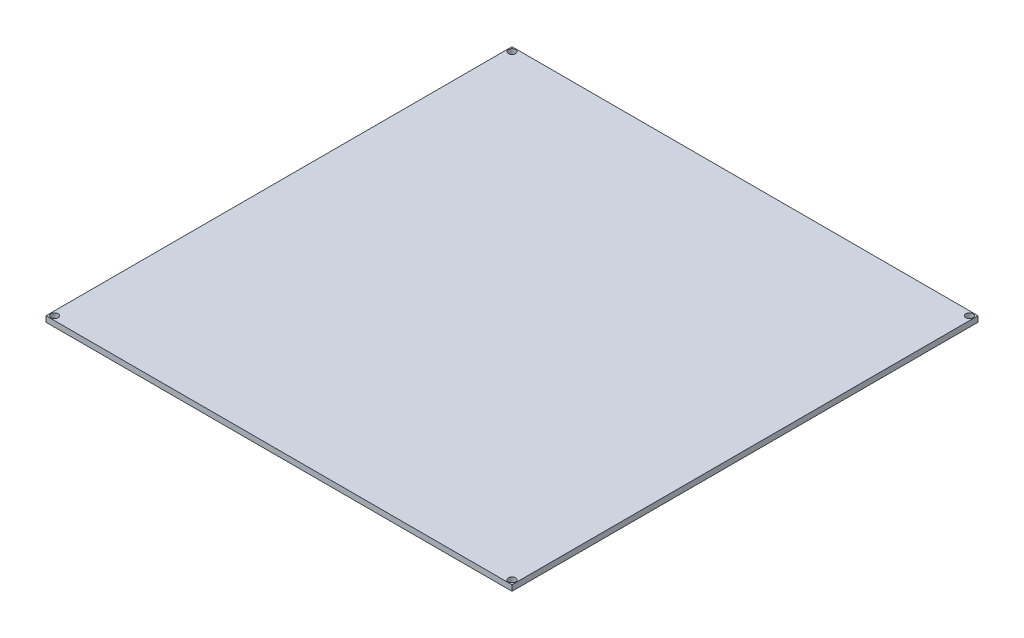
ISO-10303-21;
HEADER;
FILE_DESCRIPTION(('STEP AP214'),'2;1');
FILE_NAME('part.step','',(''),(''),'','','');
FILE_SCHEMA(('AUTOMOTIVE_DESIGN { 1 0 10303 214 1 1 1 1 }'));
ENDSEC;
DATA;
#1=APPLICATION_CONTEXT('core data for automotive mechanical design processes');
#2=APPLICATION_PROTOCOL_DEFINITION('international standard','automotive_design',2000,#1);
#3=PRODUCT_CONTEXT('',#1,'mechanical');
#4=PRODUCT('Part','Part','',(#3));
#5=PRODUCT_RELATED_PRODUCT_CATEGORY('part','',(#4));
#6=PRODUCT_DEFINITION_FORMATION('','',#4);
#7=PRODUCT_DEFINITION_CONTEXT('part definition',#1,'design');
#8=PRODUCT_DEFINITION('design','',#6,#7);
#9=PRODUCT_DEFINITION_SHAPE('','',#8);
#10=(LENGTH_UNIT() NAMED_UNIT(*) SI_UNIT(.MILLI.,.METRE.));
#11=(NAMED_UNIT(*) PLANE_ANGLE_UNIT() SI_UNIT($,.RADIAN.));
#12=(NAMED_UNIT(*) SI_UNIT($,.STERADIAN.) SOLID_ANGLE_UNIT());
#13=UNCERTAINTY_MEASURE_WITH_UNIT(LENGTH_MEASURE(1.E-05),#10,'distance_accuracy_value','');
#14=(GEOMETRIC_REPRESENTATION_CONTEXT(3) GLOBAL_UNCERTAINTY_ASSIGNED_CONTEXT((#13)) GLOBAL_UNIT_ASSIGNED_CONTEXT((#10,
#11,#12)) REPRESENTATION_CONTEXT('',''));
#15=CARTESIAN_POINT('',(0.,0.,0.));
#16=DIRECTION('',(0.,0.,1.));
#17=DIRECTION('',(1.,0.,0.));
#18=AXIS2_PLACEMENT_3D('',#15,#16,#17);
#19=CARTESIAN_POINT('',(0.,4.,0.));
#20=DIRECTION('',(0.,1.,0.));
#21=DIRECTION('',(0.,0.,1.));
#22=AXIS2_PLACEMENT_3D('',#19,#20,#21);
#23=PLANE('',#22);
#24=CARTESIAN_POINT('',(148.,4.,-95.8695652173913));
#25=DIRECTION('',(0.,1.,0.));
#26=DIRECTION('',(0.,0.,1.));
#27=AXIS2_PLACEMENT_3D('',#24,#25,#26);
#28=CIRCLE('',#27,2.5);
#29=CARTESIAN_POINT('',(148.,4.,-93.3695652173913));
#30=VERTEX_POINT('',#29);
#31=EDGE_CURVE('E120',#30,#30,#28,.T.);
#32=ORIENTED_EDGE('',*,*,#31,.F.);
#33=EDGE_LOOP('',(#32));
#34=FACE_BOUND('',#33,.T.);
#35=CARTESIAN_POINT('',(-173.,4.,225.130434782609));
#36=DIRECTION('',(0.,1.,0.));
#37=DIRECTION('',(0.,0.,1.));
#38=AXIS2_PLACEMENT_3D('',#35,#36,#37);
#39=CIRCLE('',#38,2.5);
#40=CARTESIAN_POINT('',(-173.,4.,227.630434782609));
#41=VERTEX_POINT('',#40);
#42=EDGE_CURVE('E99',#41,#41,#39,.T.);
#43=ORIENTED_EDGE('',*,*,#42,.F.);
#44=EDGE_LOOP('',(#43));
#45=FACE_BOUND('',#44,.T.);
#46=DIRECTION('',(0.,0.,1.));
#47=VECTOR('',#46,1.);
#48=CARTESIAN_POINT('',(-176.,4.,-98.8695652173913));
#49=LINE('',#48,#47);
#50=CARTESIAN_POINT('',(-176.,4.,-98.8695652173913));
#51=VERTEX_POINT('',#50);
#52=CARTESIAN_POINT('',(-176.,4.,228.130434782609));
#53=VERTEX_POINT('',#52);
#54=EDGE_CURVE('E84',#51,#53,#49,.T.);
#55=ORIENTED_EDGE('',*,*,#54,.T.);
#56=DIRECTION('',(1.,0.,0.));
#57=VECTOR('',#56,1.);
#58=CARTESIAN_POINT('',(-176.,4.,228.130434782609));
#59=LINE('',#58,#57);
#60=CARTESIAN_POINT('',(151.,4.,228.130434782609));
#61=VERTEX_POINT('',#60);
#62=EDGE_CURVE('E79',#53,#61,#59,.T.);
#63=ORIENTED_EDGE('',*,*,#62,.T.);
#64=DIRECTION('',(0.,0.,-1.));
#65=VECTOR('',#64,1.);
#66=CARTESIAN_POINT('',(151.,4.,-98.8695652173913));
#67=LINE('',#66,#65);
#68=CARTESIAN_POINT('',(151.,4.,-98.8695652173913));
#69=VERTEX_POINT('',#68);
#70=EDGE_CURVE('E82',#61,#69,#67,.T.);
#71=ORIENTED_EDGE('',*,*,#70,.T.);
#72=DIRECTION('',(-1.,0.,0.));
#73=VECTOR('',#72,1.);
#74=CARTESIAN_POINT('',(-176.,4.,-98.8695652173913));
#75=LINE('',#74,#73);
#76=EDGE_CURVE('E49',#69,#51,#75,.T.);
#77=ORIENTED_EDGE('',*,*,#76,.T.);
#78=EDGE_LOOP('',(#55,#63,#71,#77));
#79=FACE_BOUND('',#78,.T.);
#80=CARTESIAN_POINT('',(-173.,4.,-95.8695652173913));
#81=DIRECTION('',(0.,1.,0.));
#82=DIRECTION('',(0.,0.,1.));
#83=AXIS2_PLACEMENT_3D('',#80,#81,#82);
#84=CIRCLE('',#83,2.5);
#85=CARTESIAN_POINT('',(-173.,4.,-93.3695652173913));
#86=VERTEX_POINT('',#85);
#87=EDGE_CURVE('E114',#86,#86,#84,.T.);
#88=ORIENTED_EDGE('',*,*,#87,.F.);
#89=EDGE_LOOP('',(#88));
#90=FACE_BOUND('',#89,.T.);
#91=CARTESIAN_POINT('',(148.,4.,225.130434782609));
#92=DIRECTION('',(0.,1.,0.));
#93=DIRECTION('',(0.,0.,1.));
#94=AXIS2_PLACEMENT_3D('',#91,#92,#93);
#95=CIRCLE('',#94,2.5);
#96=CARTESIAN_POINT('',(148.,4.,227.630434782609));
#97=VERTEX_POINT('',#96);
#98=EDGE_CURVE('E126',#97,#97,#95,.T.);
#99=ORIENTED_EDGE('',*,*,#98,.F.);
#100=EDGE_LOOP('',(#99));
#101=FACE_BOUND('',#100,.T.);
#102=ADVANCED_FACE('F32',(#34,#45,#79,#90,#101),#23,.T.);
#103=CARTESIAN_POINT('',(0.,0.,0.));
#104=DIRECTION('',(0.,1.,0.));
#105=DIRECTION('',(0.,0.,1.));
#106=AXIS2_PLACEMENT_3D('',#103,#104,#105);
#107=PLANE('',#106);
#108=DIRECTION('',(0.,0.,1.));
#109=VECTOR('',#108,1.);
#110=CARTESIAN_POINT('',(-176.,0.,-98.8695652173913));
#111=LINE('',#110,#109);
#112=CARTESIAN_POINT('',(-176.,0.,-98.8695652173913));
#113=VERTEX_POINT('',#112);
#114=CARTESIAN_POINT('',(-176.,0.,228.130434782609));
#115=VERTEX_POINT('',#114);
#116=EDGE_CURVE('E96',#113,#115,#111,.T.);
#117=ORIENTED_EDGE('',*,*,#116,.F.);
#118=DIRECTION('',(-1.,0.,0.));
#119=VECTOR('',#118,1.);
#120=CARTESIAN_POINT('',(-176.,0.,-98.8695652173913));
#121=LINE('',#120,#119);
#122=CARTESIAN_POINT('',(151.,0.,-98.8695652173913));
#123=VERTEX_POINT('',#122);
#124=EDGE_CURVE('E72',#123,#113,#121,.T.);
#125=ORIENTED_EDGE('',*,*,#124,.F.);
#126=DIRECTION('',(0.,0.,-1.));
#127=VECTOR('',#126,1.);
#128=CARTESIAN_POINT('',(151.,0.,-98.8695652173913));
#129=LINE('',#128,#127);
#130=CARTESIAN_POINT('',(151.,0.,228.130434782609));
#131=VERTEX_POINT('',#130);
#132=EDGE_CURVE('E66',#131,#123,#129,.T.);
#133=ORIENTED_EDGE('',*,*,#132,.F.);
#134=DIRECTION('',(1.,0.,0.));
#135=VECTOR('',#134,1.);
#136=CARTESIAN_POINT('',(-176.,0.,228.130434782609));
#137=LINE('',#136,#135);
#138=EDGE_CURVE('E88',#115,#131,#137,.T.);
#139=ORIENTED_EDGE('',*,*,#138,.F.);
#140=EDGE_LOOP('',(#117,#125,#133,#139));
#141=FACE_BOUND('',#140,.T.);
#142=CARTESIAN_POINT('',(-173.,0.,225.130434782609));
#143=DIRECTION('',(0.,1.,0.));
#144=DIRECTION('',(0.,0.,1.));
#145=AXIS2_PLACEMENT_3D('',#142,#143,#144);
#146=CIRCLE('',#145,2.5);
#147=CARTESIAN_POINT('',(-173.,0.,227.630434782609));
#148=VERTEX_POINT('',#147);
#149=EDGE_CURVE('E111',#148,#148,#146,.T.);
#150=ORIENTED_EDGE('',*,*,#149,.T.);
#151=EDGE_LOOP('',(#150));
#152=FACE_BOUND('',#151,.T.);
#153=CARTESIAN_POINT('',(-173.,0.,-95.8695652173913));
#154=DIRECTION('',(0.,1.,0.));
#155=DIRECTION('',(0.,0.,1.));
#156=AXIS2_PLACEMENT_3D('',#153,#154,#155);
#157=CIRCLE('',#156,2.5);
#158=CARTESIAN_POINT('',(-173.,0.,-93.3695652173913));
#159=VERTEX_POINT('',#158);
#160=EDGE_CURVE('E117',#159,#159,#157,.T.);
#161=ORIENTED_EDGE('',*,*,#160,.T.);
#162=EDGE_LOOP('',(#161));
#163=FACE_BOUND('',#162,.T.);
#164=CARTESIAN_POINT('',(148.,0.,-95.8695652173913));
#165=DIRECTION('',(0.,1.,0.));
#166=DIRECTION('',(0.,0.,1.));
#167=AXIS2_PLACEMENT_3D('',#164,#165,#166);
#168=CIRCLE('',#167,2.5);
#169=CARTESIAN_POINT('',(148.,0.,-93.3695652173913));
#170=VERTEX_POINT('',#169);
#171=EDGE_CURVE('E123',#170,#170,#168,.T.);
#172=ORIENTED_EDGE('',*,*,#171,.T.);
#173=EDGE_LOOP('',(#172));
#174=FACE_BOUND('',#173,.T.);
#175=CARTESIAN_POINT('',(148.,0.,225.130434782609));
#176=DIRECTION('',(0.,1.,0.));
#177=DIRECTION('',(0.,0.,1.));
#178=AXIS2_PLACEMENT_3D('',#175,#176,#177);
#179=CIRCLE('',#178,2.5);
#180=CARTESIAN_POINT('',(148.,0.,227.630434782609));
#181=VERTEX_POINT('',#180);
#182=EDGE_CURVE('E129',#181,#181,#179,.T.);
#183=ORIENTED_EDGE('',*,*,#182,.T.);
#184=EDGE_LOOP('',(#183));
#185=FACE_BOUND('',#184,.T.);
#186=ADVANCED_FACE('F107',(#141,#152,#163,#174,#185),#107,.F.);
#187=CARTESIAN_POINT('',(-176.,4.,-98.8695652173913));
#188=DIRECTION('',(1.,0.,0.));
#189=DIRECTION('',(0.,0.,-1.));
#190=AXIS2_PLACEMENT_3D('',#187,#188,#189);
#191=PLANE('',#190);
#192=ORIENTED_EDGE('',*,*,#116,.T.);
#193=DIRECTION('',(0.,-1.,0.));
#194=VECTOR('',#193,1.);
#195=CARTESIAN_POINT('',(-176.,4.,228.130434782609));
#196=LINE('',#195,#194);
#197=EDGE_CURVE('E11',#53,#115,#196,.T.);
#198=ORIENTED_EDGE('',*,*,#197,.F.);
#199=ORIENTED_EDGE('',*,*,#54,.F.);
#200=DIRECTION('',(0.,-1.,0.));
#201=VECTOR('',#200,1.);
#202=CARTESIAN_POINT('',(-176.,4.,-98.8695652173913));
#203=LINE('',#202,#201);
#204=EDGE_CURVE('E92',#51,#113,#203,.T.);
#205=ORIENTED_EDGE('',*,*,#204,.T.);
#206=EDGE_LOOP('',(#192,#198,#199,#205));
#207=FACE_BOUND('',#206,.T.);
#208=ADVANCED_FACE('F34',(#207),#191,.F.);
#209=CARTESIAN_POINT('',(-176.,4.,228.130434782609));
#210=DIRECTION('',(0.,0.,-1.));
#211=DIRECTION('',(-1.,0.,0.));
#212=AXIS2_PLACEMENT_3D('',#209,#210,#211);
#213=PLANE('',#212);
#214=ORIENTED_EDGE('',*,*,#138,.T.);
#215=DIRECTION('',(0.,-1.,0.));
#216=VECTOR('',#215,1.);
#217=CARTESIAN_POINT('',(151.,4.,228.130434782609));
#218=LINE('',#217,#216);
#219=EDGE_CURVE('E41',#61,#131,#218,.T.);
#220=ORIENTED_EDGE('',*,*,#219,.F.);
#221=ORIENTED_EDGE('',*,*,#62,.F.);
#222=ORIENTED_EDGE('',*,*,#197,.T.);
#223=EDGE_LOOP('',(#214,#220,#221,#222));
#224=FACE_BOUND('',#223,.T.);
#225=ADVANCED_FACE('F87',(#224),#213,.F.);
#226=CARTESIAN_POINT('',(151.,4.,-98.8695652173913));
#227=DIRECTION('',(-1.,0.,0.));
#228=DIRECTION('',(0.,0.,1.));
#229=AXIS2_PLACEMENT_3D('',#226,#227,#228);
#230=PLANE('',#229);
#231=ORIENTED_EDGE('',*,*,#132,.T.);
#232=DIRECTION('',(0.,-1.,0.));
#233=VECTOR('',#232,1.);
#234=CARTESIAN_POINT('',(151.,4.,-98.8695652173913));
#235=LINE('',#234,#233);
#236=EDGE_CURVE('E89',#69,#123,#235,.T.);
#237=ORIENTED_EDGE('',*,*,#236,.F.);
#238=ORIENTED_EDGE('',*,*,#70,.F.);
#239=ORIENTED_EDGE('',*,*,#219,.T.);
#240=EDGE_LOOP('',(#231,#237,#238,#239));
#241=FACE_BOUND('',#240,.T.);
#242=ADVANCED_FACE('F90',(#241),#230,.F.);
#243=CARTESIAN_POINT('',(-176.,4.,-98.8695652173913));
#244=DIRECTION('',(0.,0.,1.));
#245=DIRECTION('',(1.,0.,0.));
#246=AXIS2_PLACEMENT_3D('',#243,#244,#245);
#247=PLANE('',#246);
#248=ORIENTED_EDGE('',*,*,#124,.T.);
#249=ORIENTED_EDGE('',*,*,#204,.F.);
#250=ORIENTED_EDGE('',*,*,#76,.F.);
#251=ORIENTED_EDGE('',*,*,#236,.T.);
#252=EDGE_LOOP('',(#248,#249,#250,#251));
#253=FACE_BOUND('',#252,.T.);
#254=ADVANCED_FACE('F104',(#253),#247,.F.);
#255=CARTESIAN_POINT('',(-173.,4.,225.130434782609));
#256=DIRECTION('',(0.,-1.,0.));
#257=DIRECTION('',(0.,0.,-1.));
#258=AXIS2_PLACEMENT_3D('',#255,#256,#257);
#259=CYLINDRICAL_SURFACE('',#258,2.5);
#260=ORIENTED_EDGE('',*,*,#42,.T.);
#261=EDGE_LOOP('',(#260));
#262=FACE_BOUND('',#261,.T.);
#263=ORIENTED_EDGE('',*,*,#149,.F.);
#264=EDGE_LOOP('',(#263));
#265=FACE_BOUND('',#264,.T.);
#266=ADVANCED_FACE('F148',(#262,#265),#259,.F.);
#267=CARTESIAN_POINT('',(-173.,4.,-95.8695652173913));
#268=DIRECTION('',(0.,-1.,0.));
#269=DIRECTION('',(0.,0.,-1.));
#270=AXIS2_PLACEMENT_3D('',#267,#268,#269);
#271=CYLINDRICAL_SURFACE('',#270,2.5);
#272=ORIENTED_EDGE('',*,*,#87,.T.);
#273=EDGE_LOOP('',(#272));
#274=FACE_BOUND('',#273,.T.);
#275=ORIENTED_EDGE('',*,*,#160,.F.);
#276=EDGE_LOOP('',(#275));
#277=FACE_BOUND('',#276,.T.);
#278=ADVANCED_FACE('F194',(#274,#277),#271,.F.);
#279=CARTESIAN_POINT('',(148.,4.,-95.8695652173913));
#280=DIRECTION('',(0.,-1.,0.));
#281=DIRECTION('',(0.,0.,-1.));
#282=AXIS2_PLACEMENT_3D('',#279,#280,#281);
#283=CYLINDRICAL_SURFACE('',#282,2.5);
#284=ORIENTED_EDGE('',*,*,#31,.T.);
#285=EDGE_LOOP('',(#284));
#286=FACE_BOUND('',#285,.T.);
#287=ORIENTED_EDGE('',*,*,#171,.F.);
#288=EDGE_LOOP('',(#287));
#289=FACE_BOUND('',#288,.T.);
#290=ADVANCED_FACE('F202',(#286,#289),#283,.F.);
#291=CARTESIAN_POINT('',(148.,4.,225.130434782609));
#292=DIRECTION('',(0.,-1.,0.));
#293=DIRECTION('',(0.,0.,-1.));
#294=AXIS2_PLACEMENT_3D('',#291,#292,#293);
#295=CYLINDRICAL_SURFACE('',#294,2.5);
#296=ORIENTED_EDGE('',*,*,#98,.T.);
#297=EDGE_LOOP('',(#296));
#298=FACE_BOUND('',#297,.T.);
#299=ORIENTED_EDGE('',*,*,#182,.F.);
#300=EDGE_LOOP('',(#299));
#301=FACE_BOUND('',#300,.T.);
#302=ADVANCED_FACE('F135',(#298,#301),#295,.F.);
#303=CLOSED_SHELL('',(#102,#186,#208,#225,#242,#254,#266,#278,#290,#302));
#304=MANIFOLD_SOLID_BREP('B2',#303);
#305=ADVANCED_BREP_SHAPE_REPRESENTATION('',(#18,#304),#14);
#306=SHAPE_DEFINITION_REPRESENTATION(#9,#305);
ENDSEC;
END-ISO-10303-21;
